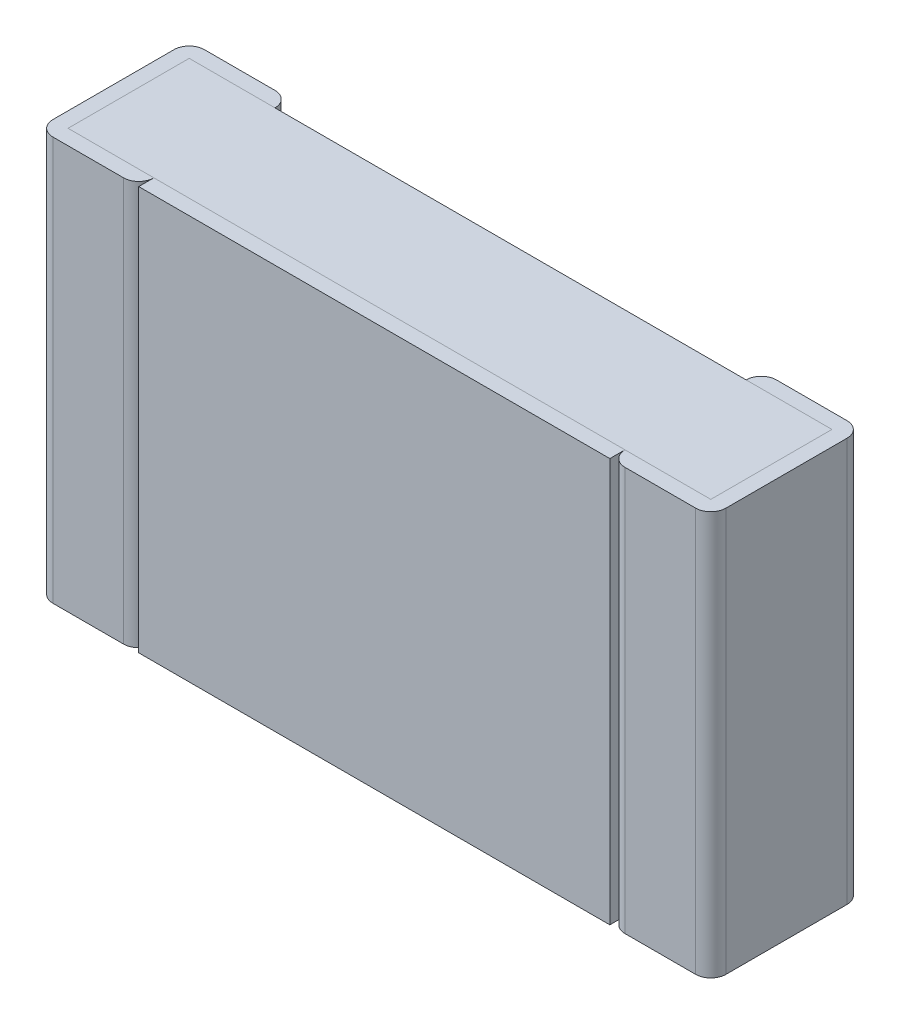
ISO-10303-21;
HEADER;
FILE_DESCRIPTION(('STEP AP214'),'2;1');
FILE_NAME('part.step','',(''),(''),'','','');
FILE_SCHEMA(('AUTOMOTIVE_DESIGN { 1 0 10303 214 1 1 1 1 }'));
ENDSEC;
DATA;
#1=APPLICATION_CONTEXT('core data for automotive mechanical design processes');
#2=APPLICATION_PROTOCOL_DEFINITION('international standard','automotive_design',2000,#1);
#3=PRODUCT_CONTEXT('',#1,'mechanical');
#4=PRODUCT('Part','Part','',(#3));
#5=PRODUCT_RELATED_PRODUCT_CATEGORY('part','',(#4));
#6=PRODUCT_DEFINITION_FORMATION('','',#4);
#7=PRODUCT_DEFINITION_CONTEXT('part definition',#1,'design');
#8=PRODUCT_DEFINITION('design','',#6,#7);
#9=PRODUCT_DEFINITION_SHAPE('','',#8);
#10=(LENGTH_UNIT() NAMED_UNIT(*) SI_UNIT(.MILLI.,.METRE.));
#11=(NAMED_UNIT(*) PLANE_ANGLE_UNIT() SI_UNIT($,.RADIAN.));
#12=(NAMED_UNIT(*) SI_UNIT($,.STERADIAN.) SOLID_ANGLE_UNIT());
#13=UNCERTAINTY_MEASURE_WITH_UNIT(LENGTH_MEASURE(1.E-05),#10,'distance_accuracy_value','');
#14=(GEOMETRIC_REPRESENTATION_CONTEXT(3) GLOBAL_UNCERTAINTY_ASSIGNED_CONTEXT((#13)) GLOBAL_UNIT_ASSIGNED_CONTEXT((#10,
#11,#12)) REPRESENTATION_CONTEXT('',''));
#15=CARTESIAN_POINT('',(0.,0.,0.));
#16=DIRECTION('',(0.,0.,1.));
#17=DIRECTION('',(1.,0.,0.));
#18=AXIS2_PLACEMENT_3D('',#15,#16,#17);
#19=CARTESIAN_POINT('',(-1.,-0.6,0.));
#20=DIRECTION('',(1.,0.,0.));
#21=DIRECTION('',(0.,1.,0.));
#22=AXIS2_PLACEMENT_3D('',#19,#20,#21);
#23=PLANE('',#22);
#24=DIRECTION('',(0.,1.,0.));
#25=VECTOR('',#24,1.);
#26=CARTESIAN_POINT('',(-1.,-0.6,0.405));
#27=LINE('',#26,#25);
#28=CARTESIAN_POINT('',(-1.,-0.6,0.405));
#29=VERTEX_POINT('',#28);
#30=CARTESIAN_POINT('',(-1.,0.6,0.405));
#31=VERTEX_POINT('',#30);
#32=EDGE_CURVE('E11',#29,#31,#27,.T.);
#33=ORIENTED_EDGE('',*,*,#32,.T.);
#34=DIRECTION('',(0.,0.,1.));
#35=VECTOR('',#34,1.);
#36=CARTESIAN_POINT('',(-1.,0.6,0.));
#37=LINE('',#36,#35);
#38=CARTESIAN_POINT('',(-1.,0.6,0.045));
#39=VERTEX_POINT('',#38);
#40=EDGE_CURVE('E40',#39,#31,#37,.T.);
#41=ORIENTED_EDGE('',*,*,#40,.F.);
#42=DIRECTION('',(0.,1.,0.));
#43=VECTOR('',#42,1.);
#44=CARTESIAN_POINT('',(-1.,-0.6,0.045));
#45=LINE('',#44,#43);
#46=CARTESIAN_POINT('',(-1.,-0.6,0.045));
#47=VERTEX_POINT('',#46);
#48=EDGE_CURVE('E377',#47,#39,#45,.T.);
#49=ORIENTED_EDGE('',*,*,#48,.F.);
#50=DIRECTION('',(0.,0.,1.));
#51=VECTOR('',#50,1.);
#52=CARTESIAN_POINT('',(-1.,-0.6,0.));
#53=LINE('',#52,#51);
#54=EDGE_CURVE('E26',#47,#29,#53,.T.);
#55=ORIENTED_EDGE('',*,*,#54,.T.);
#56=EDGE_LOOP('',(#33,#41,#49,#55));
#57=FACE_BOUND('',#56,.T.);
#58=ADVANCED_FACE('F16',(#57),#23,.F.);
#59=CARTESIAN_POINT('',(-1.,-0.6,0.));
#60=DIRECTION('',(0.,1.,0.));
#61=DIRECTION('',(1.,0.,0.));
#62=AXIS2_PLACEMENT_3D('',#59,#60,#61);
#63=PLANE('',#62);
#64=CARTESIAN_POINT('',(-0.745,-0.6,0.045));
#65=DIRECTION('',(0.,1.,0.));
#66=DIRECTION('',(0.,0.,1.));
#67=AXIS2_PLACEMENT_3D('',#64,#65,#66);
#68=CIRCLE('',#67,0.045);
#69=CARTESIAN_POINT('',(-0.7,-0.6,0.045));
#70=VERTEX_POINT('',#69);
#71=CARTESIAN_POINT('',(-0.745,-0.6,0.));
#72=VERTEX_POINT('',#71);
#73=EDGE_CURVE('E303',#70,#72,#68,.T.);
#74=ORIENTED_EDGE('',*,*,#73,.F.);
#75=DIRECTION('',(1.,0.,0.));
#76=VECTOR('',#75,1.);
#77=CARTESIAN_POINT('',(-0.955,-0.6,0.045));
#78=LINE('',#77,#76);
#79=CARTESIAN_POINT('',(-0.955,-0.6,0.045));
#80=VERTEX_POINT('',#79);
#81=EDGE_CURVE('E292',#80,#70,#78,.T.);
#82=ORIENTED_EDGE('',*,*,#81,.F.);
#83=DIRECTION('',(0.,0.,1.));
#84=VECTOR('',#83,1.);
#85=CARTESIAN_POINT('',(-0.955,-0.6,0.045));
#86=LINE('',#85,#84);
#87=CARTESIAN_POINT('',(-0.955,-0.6,0.405));
#88=VERTEX_POINT('',#87);
#89=EDGE_CURVE('E400',#80,#88,#86,.T.);
#90=ORIENTED_EDGE('',*,*,#89,.T.);
#91=DIRECTION('',(1.,0.,0.));
#92=VECTOR('',#91,1.);
#93=CARTESIAN_POINT('',(-0.955,-0.6,0.405));
#94=LINE('',#93,#92);
#95=CARTESIAN_POINT('',(-0.7,-0.6,0.405));
#96=VERTEX_POINT('',#95);
#97=EDGE_CURVE('E430',#88,#96,#94,.T.);
#98=ORIENTED_EDGE('',*,*,#97,.T.);
#99=CARTESIAN_POINT('',(-0.745,-0.6,0.405));
#100=DIRECTION('',(0.,-1.,0.));
#101=DIRECTION('',(0.,0.,1.));
#102=AXIS2_PLACEMENT_3D('',#99,#100,#101);
#103=CIRCLE('',#102,0.045);
#104=CARTESIAN_POINT('',(-0.745,-0.6,0.45));
#105=VERTEX_POINT('',#104);
#106=EDGE_CURVE('E265',#96,#105,#103,.T.);
#107=ORIENTED_EDGE('',*,*,#106,.T.);
#108=DIRECTION('',(1.,0.,0.));
#109=VECTOR('',#108,1.);
#110=CARTESIAN_POINT('',(-1.,-0.6,0.45));
#111=LINE('',#110,#109);
#112=CARTESIAN_POINT('',(-0.955,-0.6,0.45));
#113=VERTEX_POINT('',#112);
#114=EDGE_CURVE('E289',#113,#105,#111,.T.);
#115=ORIENTED_EDGE('',*,*,#114,.F.);
#116=CARTESIAN_POINT('',(-0.955,-0.6,0.405));
#117=DIRECTION('',(0.,1.,0.));
#118=DIRECTION('',(0.,0.,1.));
#119=AXIS2_PLACEMENT_3D('',#116,#117,#118);
#120=CIRCLE('',#119,0.045);
#121=EDGE_CURVE('E354',#29,#113,#120,.T.);
#122=ORIENTED_EDGE('',*,*,#121,.F.);
#123=ORIENTED_EDGE('',*,*,#54,.F.);
#124=CARTESIAN_POINT('',(-0.955,-0.6,0.045));
#125=DIRECTION('',(0.,-1.,0.));
#126=DIRECTION('',(0.,0.,1.));
#127=AXIS2_PLACEMENT_3D('',#124,#125,#126);
#128=CIRCLE('',#127,0.045);
#129=CARTESIAN_POINT('',(-0.955,-0.6,0.));
#130=VERTEX_POINT('',#129);
#131=EDGE_CURVE('E261',#47,#130,#128,.T.);
#132=ORIENTED_EDGE('',*,*,#131,.T.);
#133=DIRECTION('',(1.,0.,0.));
#134=VECTOR('',#133,1.);
#135=CARTESIAN_POINT('',(-1.,-0.6,0.));
#136=LINE('',#135,#134);
#137=EDGE_CURVE('E266',#130,#72,#136,.T.);
#138=ORIENTED_EDGE('',*,*,#137,.T.);
#139=EDGE_LOOP('',(#74,#82,#90,#98,#107,#115,#122,#123,#132,#138));
#140=FACE_BOUND('',#139,.T.);
#141=ADVANCED_FACE('F503',(#140),#63,.F.);
#142=CARTESIAN_POINT('',(-0.955,-0.6,0.045));
#143=DIRECTION('',(0.,1.,0.));
#144=DIRECTION('',(-1.,0.,0.));
#145=AXIS2_PLACEMENT_3D('',#142,#143,#144);
#146=CYLINDRICAL_SURFACE('',#145,0.045);
#147=ORIENTED_EDGE('',*,*,#48,.T.);
#148=CARTESIAN_POINT('',(-0.955,0.6,0.045));
#149=DIRECTION('',(0.,-1.,0.));
#150=DIRECTION('',(0.,0.,1.));
#151=AXIS2_PLACEMENT_3D('',#148,#149,#150);
#152=CIRCLE('',#151,0.045);
#153=CARTESIAN_POINT('',(-0.955,0.6,0.));
#154=VERTEX_POINT('',#153);
#155=EDGE_CURVE('E381',#39,#154,#152,.T.);
#156=ORIENTED_EDGE('',*,*,#155,.T.);
#157=DIRECTION('',(0.,1.,0.));
#158=VECTOR('',#157,1.);
#159=CARTESIAN_POINT('',(-0.955,-0.6,0.));
#160=LINE('',#159,#158);
#161=EDGE_CURVE('E248',#130,#154,#160,.T.);
#162=ORIENTED_EDGE('',*,*,#161,.F.);
#163=ORIENTED_EDGE('',*,*,#131,.F.);
#164=EDGE_LOOP('',(#147,#156,#162,#163));
#165=FACE_BOUND('',#164,.T.);
#166=ADVANCED_FACE('F659',(#165),#146,.T.);
#167=CARTESIAN_POINT('',(-0.955,-0.6,0.405));
#168=DIRECTION('',(0.,1.,0.));
#169=DIRECTION('',(-1.,0.,0.));
#170=AXIS2_PLACEMENT_3D('',#167,#168,#169);
#171=CYLINDRICAL_SURFACE('',#170,0.045);
#172=ORIENTED_EDGE('',*,*,#121,.T.);
#173=DIRECTION('',(0.,1.,0.));
#174=VECTOR('',#173,1.);
#175=CARTESIAN_POINT('',(-0.955,-0.6,0.45));
#176=LINE('',#175,#174);
#177=CARTESIAN_POINT('',(-0.955,0.6,0.45));
#178=VERTEX_POINT('',#177);
#179=EDGE_CURVE('E255',#113,#178,#176,.T.);
#180=ORIENTED_EDGE('',*,*,#179,.T.);
#181=CARTESIAN_POINT('',(-0.955,0.6,0.405));
#182=DIRECTION('',(0.,1.,0.));
#183=DIRECTION('',(0.,0.,1.));
#184=AXIS2_PLACEMENT_3D('',#181,#182,#183);
#185=CIRCLE('',#184,0.045);
#186=EDGE_CURVE('E256',#31,#178,#185,.T.);
#187=ORIENTED_EDGE('',*,*,#186,.F.);
#188=ORIENTED_EDGE('',*,*,#32,.F.);
#189=EDGE_LOOP('',(#172,#180,#187,#188));
#190=FACE_BOUND('',#189,.T.);
#191=ADVANCED_FACE('F623',(#190),#171,.T.);
#192=CARTESIAN_POINT('',(-1.,0.6,0.));
#193=DIRECTION('',(0.,1.,0.));
#194=DIRECTION('',(1.,0.,0.));
#195=AXIS2_PLACEMENT_3D('',#192,#193,#194);
#196=PLANE('',#195);
#197=DIRECTION('',(1.,0.,0.));
#198=VECTOR('',#197,1.);
#199=CARTESIAN_POINT('',(-1.,0.6,0.));
#200=LINE('',#199,#198);
#201=CARTESIAN_POINT('',(-0.745,0.6,0.));
#202=VERTEX_POINT('',#201);
#203=EDGE_CURVE('E252',#154,#202,#200,.T.);
#204=ORIENTED_EDGE('',*,*,#203,.F.);
#205=ORIENTED_EDGE('',*,*,#155,.F.);
#206=ORIENTED_EDGE('',*,*,#40,.T.);
#207=ORIENTED_EDGE('',*,*,#186,.T.);
#208=DIRECTION('',(1.,0.,0.));
#209=VECTOR('',#208,1.);
#210=CARTESIAN_POINT('',(-1.,0.6,0.45));
#211=LINE('',#210,#209);
#212=CARTESIAN_POINT('',(-0.745,0.6,0.45));
#213=VERTEX_POINT('',#212);
#214=EDGE_CURVE('E382',#178,#213,#211,.T.);
#215=ORIENTED_EDGE('',*,*,#214,.T.);
#216=CARTESIAN_POINT('',(-0.745,0.6,0.405));
#217=DIRECTION('',(0.,-1.,0.));
#218=DIRECTION('',(0.,0.,1.));
#219=AXIS2_PLACEMENT_3D('',#216,#217,#218);
#220=CIRCLE('',#219,0.045);
#221=CARTESIAN_POINT('',(-0.7,0.6,0.405));
#222=VERTEX_POINT('',#221);
#223=EDGE_CURVE('E404',#222,#213,#220,.T.);
#224=ORIENTED_EDGE('',*,*,#223,.F.);
#225=DIRECTION('',(1.,0.,0.));
#226=VECTOR('',#225,1.);
#227=CARTESIAN_POINT('',(-0.955,0.6,0.405));
#228=LINE('',#227,#226);
#229=CARTESIAN_POINT('',(-0.955,0.6,0.405));
#230=VERTEX_POINT('',#229);
#231=EDGE_CURVE('E416',#230,#222,#228,.T.);
#232=ORIENTED_EDGE('',*,*,#231,.F.);
#233=DIRECTION('',(0.,0.,1.));
#234=VECTOR('',#233,1.);
#235=CARTESIAN_POINT('',(-0.955,0.6,0.045));
#236=LINE('',#235,#234);
#237=CARTESIAN_POINT('',(-0.955,0.6,0.045));
#238=VERTEX_POINT('',#237);
#239=EDGE_CURVE('E407',#238,#230,#236,.T.);
#240=ORIENTED_EDGE('',*,*,#239,.F.);
#241=DIRECTION('',(1.,0.,0.));
#242=VECTOR('',#241,1.);
#243=CARTESIAN_POINT('',(-0.955,0.6,0.045));
#244=LINE('',#243,#242);
#245=CARTESIAN_POINT('',(-0.7,0.6,0.045));
#246=VERTEX_POINT('',#245);
#247=EDGE_CURVE('E242',#238,#246,#244,.T.);
#248=ORIENTED_EDGE('',*,*,#247,.T.);
#249=CARTESIAN_POINT('',(-0.745,0.6,0.045));
#250=DIRECTION('',(0.,1.,0.));
#251=DIRECTION('',(0.,0.,1.));
#252=AXIS2_PLACEMENT_3D('',#249,#250,#251);
#253=CIRCLE('',#252,0.045);
#254=EDGE_CURVE('E251',#246,#202,#253,.T.);
#255=ORIENTED_EDGE('',*,*,#254,.T.);
#256=EDGE_LOOP('',(#204,#205,#206,#207,#215,#224,#232,#240,#248,#255));
#257=FACE_BOUND('',#256,.T.);
#258=ADVANCED_FACE('F497',(#257),#196,.T.);
#259=CARTESIAN_POINT('',(-1.,-0.6,0.));
#260=DIRECTION('',(0.,0.,1.));
#261=DIRECTION('',(1.,0.,0.));
#262=AXIS2_PLACEMENT_3D('',#259,#260,#261);
#263=PLANE('',#262);
#264=DIRECTION('',(0.,1.,0.));
#265=VECTOR('',#264,1.);
#266=CARTESIAN_POINT('',(-0.745,-0.6,0.));
#267=LINE('',#266,#265);
#268=EDGE_CURVE('E299',#72,#202,#267,.T.);
#269=ORIENTED_EDGE('',*,*,#268,.F.);
#270=ORIENTED_EDGE('',*,*,#137,.F.);
#271=ORIENTED_EDGE('',*,*,#161,.T.);
#272=ORIENTED_EDGE('',*,*,#203,.T.);
#273=EDGE_LOOP('',(#269,#270,#271,#272));
#274=FACE_BOUND('',#273,.T.);
#275=ADVANCED_FACE('F521',(#274),#263,.F.);
#276=CARTESIAN_POINT('',(-0.745,-0.6,0.045));
#277=DIRECTION('',(0.,1.,0.));
#278=DIRECTION('',(1.,0.,0.));
#279=AXIS2_PLACEMENT_3D('',#276,#277,#278);
#280=CYLINDRICAL_SURFACE('',#279,0.045);
#281=ORIENTED_EDGE('',*,*,#73,.T.);
#282=ORIENTED_EDGE('',*,*,#268,.T.);
#283=ORIENTED_EDGE('',*,*,#254,.F.);
#284=DIRECTION('',(0.,1.,0.));
#285=VECTOR('',#284,1.);
#286=CARTESIAN_POINT('',(-0.7,-0.6,0.045));
#287=LINE('',#286,#285);
#288=EDGE_CURVE('E327',#70,#246,#287,.T.);
#289=ORIENTED_EDGE('',*,*,#288,.F.);
#290=EDGE_LOOP('',(#281,#282,#283,#289));
#291=FACE_BOUND('',#290,.T.);
#292=ADVANCED_FACE('F527',(#291),#280,.T.);
#293=CARTESIAN_POINT('',(-0.955,-0.6,0.045));
#294=DIRECTION('',(0.,1.,0.));
#295=DIRECTION('',(1.,0.,0.));
#296=AXIS2_PLACEMENT_3D('',#293,#294,#295);
#297=PLANE('',#296);
#298=DIRECTION('',(1.,0.,0.));
#299=VECTOR('',#298,1.);
#300=CARTESIAN_POINT('',(-0.955,-0.6,0.045));
#301=LINE('',#300,#299);
#302=CARTESIAN_POINT('',(0.7,-0.6,0.045));
#303=VERTEX_POINT('',#302);
#304=EDGE_CURVE('E304',#70,#303,#301,.T.);
#305=ORIENTED_EDGE('',*,*,#304,.T.);
#306=DIRECTION('',(1.,0.,0.));
#307=VECTOR('',#306,1.);
#308=CARTESIAN_POINT('',(-0.955,-0.6,0.045));
#309=LINE('',#308,#307);
#310=CARTESIAN_POINT('',(0.955,-0.6,0.045));
#311=VERTEX_POINT('',#310);
#312=EDGE_CURVE('E308',#303,#311,#309,.T.);
#313=ORIENTED_EDGE('',*,*,#312,.T.);
#314=DIRECTION('',(0.,0.,1.));
#315=VECTOR('',#314,1.);
#316=CARTESIAN_POINT('',(0.955,-0.6,0.045));
#317=LINE('',#316,#315);
#318=CARTESIAN_POINT('',(0.955,-0.6,0.405));
#319=VERTEX_POINT('',#318);
#320=EDGE_CURVE('E305',#311,#319,#317,.T.);
#321=ORIENTED_EDGE('',*,*,#320,.T.);
#322=DIRECTION('',(1.,0.,0.));
#323=VECTOR('',#322,1.);
#324=CARTESIAN_POINT('',(-0.955,-0.6,0.405));
#325=LINE('',#324,#323);
#326=CARTESIAN_POINT('',(0.7,-0.6,0.405));
#327=VERTEX_POINT('',#326);
#328=EDGE_CURVE('E285',#327,#319,#325,.T.);
#329=ORIENTED_EDGE('',*,*,#328,.F.);
#330=DIRECTION('',(1.,0.,0.));
#331=VECTOR('',#330,1.);
#332=CARTESIAN_POINT('',(-0.7,-0.6,0.405));
#333=LINE('',#332,#331);
#334=EDGE_CURVE('E233',#96,#327,#333,.T.);
#335=ORIENTED_EDGE('',*,*,#334,.F.);
#336=ORIENTED_EDGE('',*,*,#97,.F.);
#337=ORIENTED_EDGE('',*,*,#89,.F.);
#338=ORIENTED_EDGE('',*,*,#81,.T.);
#339=EDGE_LOOP('',(#305,#313,#321,#329,#335,#336,#337,#338));
#340=FACE_BOUND('',#339,.T.);
#341=ADVANCED_FACE('F484',(#340),#297,.F.);
#342=CARTESIAN_POINT('',(-1.,-0.6,0.45));
#343=DIRECTION('',(0.,0.,1.));
#344=DIRECTION('',(1.,0.,0.));
#345=AXIS2_PLACEMENT_3D('',#342,#343,#344);
#346=PLANE('',#345);
#347=ORIENTED_EDGE('',*,*,#214,.F.);
#348=ORIENTED_EDGE('',*,*,#179,.F.);
#349=ORIENTED_EDGE('',*,*,#114,.T.);
#350=DIRECTION('',(0.,1.,0.));
#351=VECTOR('',#350,1.);
#352=CARTESIAN_POINT('',(-0.745,-0.6,0.45));
#353=LINE('',#352,#351);
#354=EDGE_CURVE('E293',#105,#213,#353,.T.);
#355=ORIENTED_EDGE('',*,*,#354,.T.);
#356=EDGE_LOOP('',(#347,#348,#349,#355));
#357=FACE_BOUND('',#356,.T.);
#358=ADVANCED_FACE('F545',(#357),#346,.T.);
#359=CARTESIAN_POINT('',(-0.745,-0.6,0.405));
#360=DIRECTION('',(0.,1.,0.));
#361=DIRECTION('',(1.,0.,0.));
#362=AXIS2_PLACEMENT_3D('',#359,#360,#361);
#363=CYLINDRICAL_SURFACE('',#362,0.045);
#364=DIRECTION('',(0.,1.,0.));
#365=VECTOR('',#364,1.);
#366=CARTESIAN_POINT('',(-0.7,-0.6,0.405));
#367=LINE('',#366,#365);
#368=EDGE_CURVE('E224',#96,#222,#367,.T.);
#369=ORIENTED_EDGE('',*,*,#368,.T.);
#370=ORIENTED_EDGE('',*,*,#223,.T.);
#371=ORIENTED_EDGE('',*,*,#354,.F.);
#372=ORIENTED_EDGE('',*,*,#106,.F.);
#373=EDGE_LOOP('',(#369,#370,#371,#372));
#374=FACE_BOUND('',#373,.T.);
#375=ADVANCED_FACE('F500',(#374),#363,.T.);
#376=CARTESIAN_POINT('',(-0.955,0.6,0.045));
#377=DIRECTION('',(0.,1.,0.));
#378=DIRECTION('',(1.,0.,0.));
#379=AXIS2_PLACEMENT_3D('',#376,#377,#378);
#380=PLANE('',#379);
#381=ORIENTED_EDGE('',*,*,#247,.F.);
#382=ORIENTED_EDGE('',*,*,#239,.T.);
#383=ORIENTED_EDGE('',*,*,#231,.T.);
#384=DIRECTION('',(1.,0.,0.));
#385=VECTOR('',#384,1.);
#386=CARTESIAN_POINT('',(-0.7,0.6,0.405));
#387=LINE('',#386,#385);
#388=CARTESIAN_POINT('',(0.7,0.6,0.405));
#389=VERTEX_POINT('',#388);
#390=EDGE_CURVE('E246',#222,#389,#387,.T.);
#391=ORIENTED_EDGE('',*,*,#390,.T.);
#392=DIRECTION('',(1.,0.,0.));
#393=VECTOR('',#392,1.);
#394=CARTESIAN_POINT('',(-0.955,0.6,0.405));
#395=LINE('',#394,#393);
#396=CARTESIAN_POINT('',(0.955,0.6,0.405));
#397=VERTEX_POINT('',#396);
#398=EDGE_CURVE('E244',#389,#397,#395,.T.);
#399=ORIENTED_EDGE('',*,*,#398,.T.);
#400=DIRECTION('',(0.,0.,1.));
#401=VECTOR('',#400,1.);
#402=CARTESIAN_POINT('',(0.955,0.6,0.045));
#403=LINE('',#402,#401);
#404=CARTESIAN_POINT('',(0.955,0.6,0.045));
#405=VERTEX_POINT('',#404);
#406=EDGE_CURVE('E309',#405,#397,#403,.T.);
#407=ORIENTED_EDGE('',*,*,#406,.F.);
#408=DIRECTION('',(1.,0.,0.));
#409=VECTOR('',#408,1.);
#410=CARTESIAN_POINT('',(-0.955,0.6,0.045));
#411=LINE('',#410,#409);
#412=CARTESIAN_POINT('',(0.7,0.6,0.045));
#413=VERTEX_POINT('',#412);
#414=EDGE_CURVE('E227',#413,#405,#411,.T.);
#415=ORIENTED_EDGE('',*,*,#414,.F.);
#416=DIRECTION('',(1.,0.,0.));
#417=VECTOR('',#416,1.);
#418=CARTESIAN_POINT('',(-0.955,0.6,0.045));
#419=LINE('',#418,#417);
#420=EDGE_CURVE('E247',#246,#413,#419,.T.);
#421=ORIENTED_EDGE('',*,*,#420,.F.);
#422=EDGE_LOOP('',(#381,#382,#383,#391,#399,#407,#415,#421));
#423=FACE_BOUND('',#422,.T.);
#424=ADVANCED_FACE('F495',(#423),#380,.T.);
#425=CARTESIAN_POINT('',(-0.955,-0.6,0.045));
#426=DIRECTION('',(0.,0.,1.));
#427=DIRECTION('',(1.,0.,0.));
#428=AXIS2_PLACEMENT_3D('',#425,#426,#427);
#429=PLANE('',#428);
#430=ORIENTED_EDGE('',*,*,#420,.T.);
#431=DIRECTION('',(0.,1.,0.));
#432=VECTOR('',#431,1.);
#433=CARTESIAN_POINT('',(0.7,-0.6,0.045));
#434=LINE('',#433,#432);
#435=EDGE_CURVE('E274',#303,#413,#434,.T.);
#436=ORIENTED_EDGE('',*,*,#435,.F.);
#437=ORIENTED_EDGE('',*,*,#304,.F.);
#438=ORIENTED_EDGE('',*,*,#288,.T.);
#439=EDGE_LOOP('',(#430,#436,#437,#438));
#440=FACE_BOUND('',#439,.T.);
#441=ADVANCED_FACE('F510',(#440),#429,.F.);
#442=CARTESIAN_POINT('',(0.7,-0.6,0.));
#443=DIRECTION('',(0.,1.,0.));
#444=DIRECTION('',(1.,0.,0.));
#445=AXIS2_PLACEMENT_3D('',#442,#443,#444);
#446=PLANE('',#445);
#447=CARTESIAN_POINT('',(0.955,-0.6,0.045));
#448=DIRECTION('',(0.,1.,0.));
#449=DIRECTION('',(0.,0.,1.));
#450=AXIS2_PLACEMENT_3D('',#447,#448,#449);
#451=CIRCLE('',#450,0.045);
#452=CARTESIAN_POINT('',(1.,-0.6,0.045));
#453=VERTEX_POINT('',#452);
#454=CARTESIAN_POINT('',(0.955,-0.6,0.));
#455=VERTEX_POINT('',#454);
#456=EDGE_CURVE('E318',#453,#455,#451,.T.);
#457=ORIENTED_EDGE('',*,*,#456,.F.);
#458=DIRECTION('',(0.,0.,1.));
#459=VECTOR('',#458,1.);
#460=CARTESIAN_POINT('',(1.,-0.6,0.));
#461=LINE('',#460,#459);
#462=CARTESIAN_POINT('',(1.,-0.6,0.405));
#463=VERTEX_POINT('',#462);
#464=EDGE_CURVE('E324',#453,#463,#461,.T.);
#465=ORIENTED_EDGE('',*,*,#464,.T.);
#466=CARTESIAN_POINT('',(0.955,-0.6,0.405));
#467=DIRECTION('',(0.,-1.,0.));
#468=DIRECTION('',(0.,0.,1.));
#469=AXIS2_PLACEMENT_3D('',#466,#467,#468);
#470=CIRCLE('',#469,0.045);
#471=CARTESIAN_POINT('',(0.955,-0.6,0.45));
#472=VERTEX_POINT('',#471);
#473=EDGE_CURVE('E328',#463,#472,#470,.T.);
#474=ORIENTED_EDGE('',*,*,#473,.T.);
#475=DIRECTION('',(1.,0.,0.));
#476=VECTOR('',#475,1.);
#477=CARTESIAN_POINT('',(0.7,-0.6,0.45));
#478=LINE('',#477,#476);
#479=CARTESIAN_POINT('',(0.745,-0.6,0.45));
#480=VERTEX_POINT('',#479);
#481=EDGE_CURVE('E260',#480,#472,#478,.T.);
#482=ORIENTED_EDGE('',*,*,#481,.F.);
#483=CARTESIAN_POINT('',(0.745,-0.6,0.405));
#484=DIRECTION('',(0.,1.,0.));
#485=DIRECTION('',(0.,0.,1.));
#486=AXIS2_PLACEMENT_3D('',#483,#484,#485);
#487=CIRCLE('',#486,0.045);
#488=EDGE_CURVE('E317',#327,#480,#487,.T.);
#489=ORIENTED_EDGE('',*,*,#488,.F.);
#490=ORIENTED_EDGE('',*,*,#328,.T.);
#491=ORIENTED_EDGE('',*,*,#320,.F.);
#492=ORIENTED_EDGE('',*,*,#312,.F.);
#493=CARTESIAN_POINT('',(0.745,-0.6,0.045));
#494=DIRECTION('',(0.,-1.,0.));
#495=DIRECTION('',(0.,0.,1.));
#496=AXIS2_PLACEMENT_3D('',#493,#494,#495);
#497=CIRCLE('',#496,0.045);
#498=CARTESIAN_POINT('',(0.745,-0.6,0.));
#499=VERTEX_POINT('',#498);
#500=EDGE_CURVE('E281',#303,#499,#497,.T.);
#501=ORIENTED_EDGE('',*,*,#500,.T.);
#502=DIRECTION('',(1.,0.,0.));
#503=VECTOR('',#502,1.);
#504=CARTESIAN_POINT('',(0.7,-0.6,0.));
#505=LINE('',#504,#503);
#506=EDGE_CURVE('E286',#499,#455,#505,.T.);
#507=ORIENTED_EDGE('',*,*,#506,.T.);
#508=EDGE_LOOP('',(#457,#465,#474,#482,#489,#490,#491,#492,#501,#507));
#509=FACE_BOUND('',#508,.T.);
#510=ADVANCED_FACE('F487',(#509),#446,.F.);
#511=CARTESIAN_POINT('',(-0.7,-0.6,0.405));
#512=DIRECTION('',(0.,1.,0.));
#513=DIRECTION('',(1.,0.,0.));
#514=AXIS2_PLACEMENT_3D('',#511,#512,#513);
#515=PLANE('',#514);
#516=DIRECTION('',(0.,0.,1.));
#517=VECTOR('',#516,1.);
#518=CARTESIAN_POINT('',(0.7,-0.6,0.405));
#519=LINE('',#518,#517);
#520=CARTESIAN_POINT('',(0.7,-0.6,0.45));
#521=VERTEX_POINT('',#520);
#522=EDGE_CURVE('E207',#327,#521,#519,.T.);
#523=ORIENTED_EDGE('',*,*,#522,.T.);
#524=DIRECTION('',(1.,0.,0.));
#525=VECTOR('',#524,1.);
#526=CARTESIAN_POINT('',(-0.7,-0.6,0.45));
#527=LINE('',#526,#525);
#528=CARTESIAN_POINT('',(-0.7,-0.6,0.45));
#529=VERTEX_POINT('',#528);
#530=EDGE_CURVE('E201',#529,#521,#527,.T.);
#531=ORIENTED_EDGE('',*,*,#530,.F.);
#532=DIRECTION('',(0.,0.,1.));
#533=VECTOR('',#532,1.);
#534=CARTESIAN_POINT('',(-0.7,-0.6,0.405));
#535=LINE('',#534,#533);
#536=EDGE_CURVE('E205',#96,#529,#535,.T.);
#537=ORIENTED_EDGE('',*,*,#536,.F.);
#538=ORIENTED_EDGE('',*,*,#334,.T.);
#539=EDGE_LOOP('',(#523,#531,#537,#538));
#540=FACE_BOUND('',#539,.T.);
#541=ADVANCED_FACE('F203',(#540),#515,.F.);
#542=CARTESIAN_POINT('',(-0.7,-0.6,0.405));
#543=DIRECTION('',(1.,0.,0.));
#544=DIRECTION('',(0.,1.,0.));
#545=AXIS2_PLACEMENT_3D('',#542,#543,#544);
#546=PLANE('',#545);
#547=DIRECTION('',(0.,1.,0.));
#548=VECTOR('',#547,1.);
#549=CARTESIAN_POINT('',(-0.7,-0.6,0.45));
#550=LINE('',#549,#548);
#551=CARTESIAN_POINT('',(-0.7,0.6,0.45));
#552=VERTEX_POINT('',#551);
#553=EDGE_CURVE('E221',#529,#552,#550,.T.);
#554=ORIENTED_EDGE('',*,*,#553,.T.);
#555=DIRECTION('',(0.,0.,1.));
#556=VECTOR('',#555,1.);
#557=CARTESIAN_POINT('',(-0.7,0.6,0.405));
#558=LINE('',#557,#556);
#559=EDGE_CURVE('E273',#222,#552,#558,.T.);
#560=ORIENTED_EDGE('',*,*,#559,.F.);
#561=ORIENTED_EDGE('',*,*,#368,.F.);
#562=ORIENTED_EDGE('',*,*,#536,.T.);
#563=EDGE_LOOP('',(#554,#560,#561,#562));
#564=FACE_BOUND('',#563,.T.);
#565=ADVANCED_FACE('F219',(#564),#546,.F.);
#566=CARTESIAN_POINT('',(0.7,0.6,0.));
#567=DIRECTION('',(0.,1.,0.));
#568=DIRECTION('',(1.,0.,0.));
#569=AXIS2_PLACEMENT_3D('',#566,#567,#568);
#570=PLANE('',#569);
#571=DIRECTION('',(1.,0.,0.));
#572=VECTOR('',#571,1.);
#573=CARTESIAN_POINT('',(0.7,0.6,0.));
#574=LINE('',#573,#572);
#575=CARTESIAN_POINT('',(0.745,0.6,0.));
#576=VERTEX_POINT('',#575);
#577=CARTESIAN_POINT('',(0.955,0.6,0.));
#578=VERTEX_POINT('',#577);
#579=EDGE_CURVE('E19',#576,#578,#574,.T.);
#580=ORIENTED_EDGE('',*,*,#579,.F.);
#581=CARTESIAN_POINT('',(0.745,0.6,0.045));
#582=DIRECTION('',(0.,-1.,0.));
#583=DIRECTION('',(0.,0.,1.));
#584=AXIS2_PLACEMENT_3D('',#581,#582,#583);
#585=CIRCLE('',#584,0.045);
#586=EDGE_CURVE('E437',#413,#576,#585,.T.);
#587=ORIENTED_EDGE('',*,*,#586,.F.);
#588=ORIENTED_EDGE('',*,*,#414,.T.);
#589=ORIENTED_EDGE('',*,*,#406,.T.);
#590=ORIENTED_EDGE('',*,*,#398,.F.);
#591=CARTESIAN_POINT('',(0.745,0.6,0.405));
#592=DIRECTION('',(0.,1.,0.));
#593=DIRECTION('',(0.,0.,1.));
#594=AXIS2_PLACEMENT_3D('',#591,#592,#593);
#595=CIRCLE('',#594,0.045);
#596=CARTESIAN_POINT('',(0.745,0.6,0.45));
#597=VERTEX_POINT('',#596);
#598=EDGE_CURVE('E313',#389,#597,#595,.T.);
#599=ORIENTED_EDGE('',*,*,#598,.T.);
#600=DIRECTION('',(1.,0.,0.));
#601=VECTOR('',#600,1.);
#602=CARTESIAN_POINT('',(0.7,0.6,0.45));
#603=LINE('',#602,#601);
#604=CARTESIAN_POINT('',(0.955,0.6,0.45));
#605=VERTEX_POINT('',#604);
#606=EDGE_CURVE('E372',#597,#605,#603,.T.);
#607=ORIENTED_EDGE('',*,*,#606,.T.);
#608=CARTESIAN_POINT('',(0.955,0.6,0.405));
#609=DIRECTION('',(0.,-1.,0.));
#610=DIRECTION('',(0.,0.,1.));
#611=AXIS2_PLACEMENT_3D('',#608,#609,#610);
#612=CIRCLE('',#611,0.045);
#613=CARTESIAN_POINT('',(1.,0.6,0.405));
#614=VERTEX_POINT('',#613);
#615=EDGE_CURVE('E148',#614,#605,#612,.T.);
#616=ORIENTED_EDGE('',*,*,#615,.F.);
#617=DIRECTION('',(0.,0.,1.));
#618=VECTOR('',#617,1.);
#619=CARTESIAN_POINT('',(1.,0.6,0.));
#620=LINE('',#619,#618);
#621=CARTESIAN_POINT('',(1.,0.6,0.045));
#622=VERTEX_POINT('',#621);
#623=EDGE_CURVE('E280',#622,#614,#620,.T.);
#624=ORIENTED_EDGE('',*,*,#623,.F.);
#625=CARTESIAN_POINT('',(0.955,0.6,0.045));
#626=DIRECTION('',(0.,1.,0.));
#627=DIRECTION('',(0.,0.,1.));
#628=AXIS2_PLACEMENT_3D('',#625,#626,#627);
#629=CIRCLE('',#628,0.045);
#630=EDGE_CURVE('E366',#622,#578,#629,.T.);
#631=ORIENTED_EDGE('',*,*,#630,.T.);
#632=EDGE_LOOP('',(#580,#587,#588,#589,#590,#599,#607,#616,#624,#631));
#633=FACE_BOUND('',#632,.T.);
#634=ADVANCED_FACE('F494',(#633),#570,.T.);
#635=CARTESIAN_POINT('',(-0.7,0.6,0.405));
#636=DIRECTION('',(0.,1.,0.));
#637=DIRECTION('',(1.,0.,0.));
#638=AXIS2_PLACEMENT_3D('',#635,#636,#637);
#639=PLANE('',#638);
#640=ORIENTED_EDGE('',*,*,#390,.F.);
#641=ORIENTED_EDGE('',*,*,#559,.T.);
#642=DIRECTION('',(1.,0.,0.));
#643=VECTOR('',#642,1.);
#644=CARTESIAN_POINT('',(-0.7,0.6,0.45));
#645=LINE('',#644,#643);
#646=CARTESIAN_POINT('',(0.7,0.6,0.45));
#647=VERTEX_POINT('',#646);
#648=EDGE_CURVE('E231',#552,#647,#645,.T.);
#649=ORIENTED_EDGE('',*,*,#648,.T.);
#650=DIRECTION('',(0.,0.,1.));
#651=VECTOR('',#650,1.);
#652=CARTESIAN_POINT('',(0.7,0.6,0.405));
#653=LINE('',#652,#651);
#654=EDGE_CURVE('E213',#389,#647,#653,.T.);
#655=ORIENTED_EDGE('',*,*,#654,.F.);
#656=EDGE_LOOP('',(#640,#641,#649,#655));
#657=FACE_BOUND('',#656,.T.);
#658=ADVANCED_FACE('F362',(#657),#639,.T.);
#659=CARTESIAN_POINT('',(0.745,-0.6,0.045));
#660=DIRECTION('',(0.,1.,0.));
#661=DIRECTION('',(-1.,0.,0.));
#662=AXIS2_PLACEMENT_3D('',#659,#660,#661);
#663=CYLINDRICAL_SURFACE('',#662,0.045);
#664=ORIENTED_EDGE('',*,*,#435,.T.);
#665=ORIENTED_EDGE('',*,*,#586,.T.);
#666=DIRECTION('',(0.,1.,0.));
#667=VECTOR('',#666,1.);
#668=CARTESIAN_POINT('',(0.745,-0.6,0.));
#669=LINE('',#668,#667);
#670=EDGE_CURVE('E433',#499,#576,#669,.T.);
#671=ORIENTED_EDGE('',*,*,#670,.F.);
#672=ORIENTED_EDGE('',*,*,#500,.F.);
#673=EDGE_LOOP('',(#664,#665,#671,#672));
#674=FACE_BOUND('',#673,.T.);
#675=ADVANCED_FACE('F632',(#674),#663,.T.);
#676=CARTESIAN_POINT('',(0.7,-0.6,0.));
#677=DIRECTION('',(0.,0.,1.));
#678=DIRECTION('',(1.,0.,0.));
#679=AXIS2_PLACEMENT_3D('',#676,#677,#678);
#680=PLANE('',#679);
#681=DIRECTION('',(0.,1.,0.));
#682=VECTOR('',#681,1.);
#683=CARTESIAN_POINT('',(0.955,-0.6,0.));
#684=LINE('',#683,#682);
#685=EDGE_CURVE('E279',#455,#578,#684,.T.);
#686=ORIENTED_EDGE('',*,*,#685,.F.);
#687=ORIENTED_EDGE('',*,*,#506,.F.);
#688=ORIENTED_EDGE('',*,*,#670,.T.);
#689=ORIENTED_EDGE('',*,*,#579,.T.);
#690=EDGE_LOOP('',(#686,#687,#688,#689));
#691=FACE_BOUND('',#690,.T.);
#692=ADVANCED_FACE('F613',(#691),#680,.F.);
#693=CARTESIAN_POINT('',(0.955,-0.6,0.045));
#694=DIRECTION('',(0.,1.,0.));
#695=DIRECTION('',(1.,0.,0.));
#696=AXIS2_PLACEMENT_3D('',#693,#694,#695);
#697=CYLINDRICAL_SURFACE('',#696,0.045);
#698=ORIENTED_EDGE('',*,*,#456,.T.);
#699=ORIENTED_EDGE('',*,*,#685,.T.);
#700=ORIENTED_EDGE('',*,*,#630,.F.);
#701=DIRECTION('',(0.,1.,0.));
#702=VECTOR('',#701,1.);
#703=CARTESIAN_POINT('',(1.,-0.6,0.045));
#704=LINE('',#703,#702);
#705=EDGE_CURVE('E275',#453,#622,#704,.T.);
#706=ORIENTED_EDGE('',*,*,#705,.F.);
#707=EDGE_LOOP('',(#698,#699,#700,#706));
#708=FACE_BOUND('',#707,.T.);
#709=ADVANCED_FACE('F578',(#708),#697,.T.);
#710=CARTESIAN_POINT('',(1.,-0.6,0.));
#711=DIRECTION('',(1.,0.,0.));
#712=DIRECTION('',(0.,1.,0.));
#713=AXIS2_PLACEMENT_3D('',#710,#711,#712);
#714=PLANE('',#713);
#715=ORIENTED_EDGE('',*,*,#464,.F.);
#716=ORIENTED_EDGE('',*,*,#705,.T.);
#717=ORIENTED_EDGE('',*,*,#623,.T.);
#718=DIRECTION('',(0.,1.,0.));
#719=VECTOR('',#718,1.);
#720=CARTESIAN_POINT('',(1.,-0.6,0.405));
#721=LINE('',#720,#719);
#722=EDGE_CURVE('E259',#463,#614,#721,.T.);
#723=ORIENTED_EDGE('',*,*,#722,.F.);
#724=EDGE_LOOP('',(#715,#716,#717,#723));
#725=FACE_BOUND('',#724,.T.);
#726=ADVANCED_FACE('F573',(#725),#714,.T.);
#727=CARTESIAN_POINT('',(0.955,-0.6,0.405));
#728=DIRECTION('',(0.,1.,0.));
#729=DIRECTION('',(1.,0.,0.));
#730=AXIS2_PLACEMENT_3D('',#727,#728,#729);
#731=CYLINDRICAL_SURFACE('',#730,0.045);
#732=ORIENTED_EDGE('',*,*,#722,.T.);
#733=ORIENTED_EDGE('',*,*,#615,.T.);
#734=DIRECTION('',(0.,1.,0.));
#735=VECTOR('',#734,1.);
#736=CARTESIAN_POINT('',(0.955,-0.6,0.45));
#737=LINE('',#736,#735);
#738=EDGE_CURVE('E270',#472,#605,#737,.T.);
#739=ORIENTED_EDGE('',*,*,#738,.F.);
#740=ORIENTED_EDGE('',*,*,#473,.F.);
#741=EDGE_LOOP('',(#732,#733,#739,#740));
#742=FACE_BOUND('',#741,.T.);
#743=ADVANCED_FACE('F577',(#742),#731,.T.);
#744=CARTESIAN_POINT('',(0.7,-0.6,0.45));
#745=DIRECTION('',(0.,0.,1.));
#746=DIRECTION('',(1.,0.,0.));
#747=AXIS2_PLACEMENT_3D('',#744,#745,#746);
#748=PLANE('',#747);
#749=ORIENTED_EDGE('',*,*,#606,.F.);
#750=DIRECTION('',(0.,1.,0.));
#751=VECTOR('',#750,1.);
#752=CARTESIAN_POINT('',(0.745,-0.6,0.45));
#753=LINE('',#752,#751);
#754=EDGE_CURVE('E298',#480,#597,#753,.T.);
#755=ORIENTED_EDGE('',*,*,#754,.F.);
#756=ORIENTED_EDGE('',*,*,#481,.T.);
#757=ORIENTED_EDGE('',*,*,#738,.T.);
#758=EDGE_LOOP('',(#749,#755,#756,#757));
#759=FACE_BOUND('',#758,.T.);
#760=ADVANCED_FACE('F539',(#759),#748,.T.);
#761=CARTESIAN_POINT('',(0.745,-0.6,0.405));
#762=DIRECTION('',(0.,1.,0.));
#763=DIRECTION('',(-1.,0.,0.));
#764=AXIS2_PLACEMENT_3D('',#761,#762,#763);
#765=CYLINDRICAL_SURFACE('',#764,0.045);
#766=ORIENTED_EDGE('',*,*,#488,.T.);
#767=ORIENTED_EDGE('',*,*,#754,.T.);
#768=ORIENTED_EDGE('',*,*,#598,.F.);
#769=DIRECTION('',(0.,1.,0.));
#770=VECTOR('',#769,1.);
#771=CARTESIAN_POINT('',(0.7,-0.6,0.405));
#772=LINE('',#771,#770);
#773=EDGE_CURVE('E294',#327,#389,#772,.T.);
#774=ORIENTED_EDGE('',*,*,#773,.F.);
#775=EDGE_LOOP('',(#766,#767,#768,#774));
#776=FACE_BOUND('',#775,.T.);
#777=ADVANCED_FACE('F491',(#776),#765,.T.);
#778=CARTESIAN_POINT('',(0.7,-0.6,0.405));
#779=DIRECTION('',(1.,0.,0.));
#780=DIRECTION('',(0.,1.,0.));
#781=AXIS2_PLACEMENT_3D('',#778,#779,#780);
#782=PLANE('',#781);
#783=ORIENTED_EDGE('',*,*,#522,.F.);
#784=ORIENTED_EDGE('',*,*,#773,.T.);
#785=ORIENTED_EDGE('',*,*,#654,.T.);
#786=DIRECTION('',(0.,1.,0.));
#787=VECTOR('',#786,1.);
#788=CARTESIAN_POINT('',(0.7,-0.6,0.45));
#789=LINE('',#788,#787);
#790=EDGE_CURVE('E214',#521,#647,#789,.T.);
#791=ORIENTED_EDGE('',*,*,#790,.F.);
#792=EDGE_LOOP('',(#783,#784,#785,#791));
#793=FACE_BOUND('',#792,.T.);
#794=ADVANCED_FACE('F358',(#793),#782,.T.);
#795=CARTESIAN_POINT('',(-0.7,-0.6,0.45));
#796=DIRECTION('',(0.,0.,1.));
#797=DIRECTION('',(1.,0.,0.));
#798=AXIS2_PLACEMENT_3D('',#795,#796,#797);
#799=PLANE('',#798);
#800=ORIENTED_EDGE('',*,*,#553,.F.);
#801=ORIENTED_EDGE('',*,*,#530,.T.);
#802=ORIENTED_EDGE('',*,*,#790,.T.);
#803=ORIENTED_EDGE('',*,*,#648,.F.);
#804=EDGE_LOOP('',(#800,#801,#802,#803));
#805=FACE_BOUND('',#804,.T.);
#806=ADVANCED_FACE('F229',(#805),#799,.T.);
#807=CLOSED_SHELL('',(#58,#141,#166,#191,#258,#275,#292,#341,#358,#375,#424,#441,#510,#541,#565,
#634,#658,#675,#692,#709,#726,#743,#760,#777,#794,#806));
#808=MANIFOLD_SOLID_BREP('B1',#807);
#809=ADVANCED_BREP_SHAPE_REPRESENTATION('',(#18,#808),#14);
#810=SHAPE_DEFINITION_REPRESENTATION(#9,#809);
ENDSEC;
END-ISO-10303-21;
